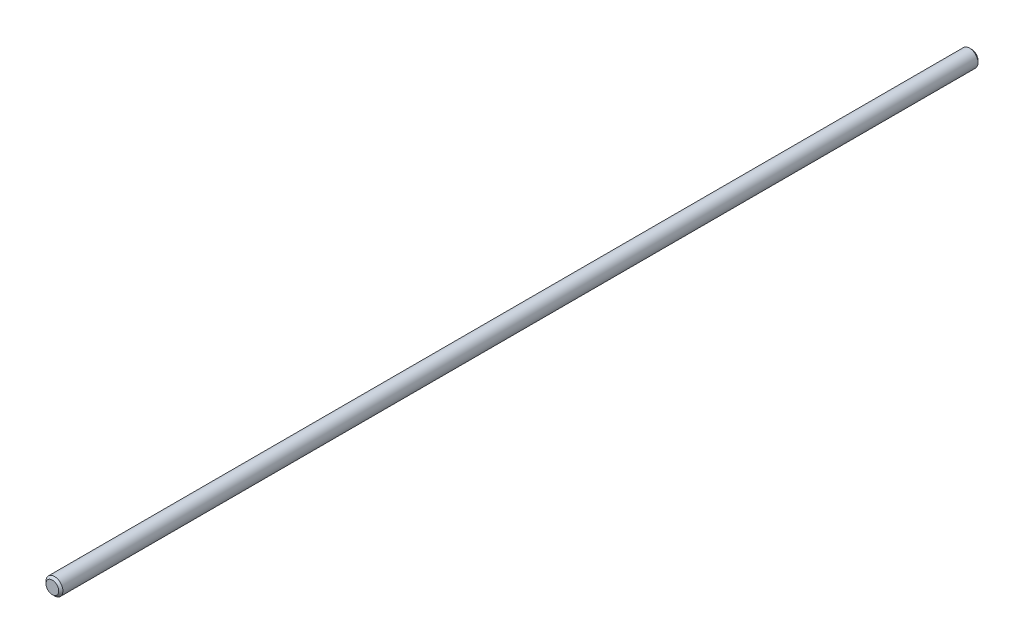
ISO-10303-21;
HEADER;
FILE_DESCRIPTION(('STEP AP214'),'2;1');
FILE_NAME('part.step','',(''),(''),'','','');
FILE_SCHEMA(('AUTOMOTIVE_DESIGN { 1 0 10303 214 1 1 1 1 }'));
ENDSEC;
DATA;
#1=APPLICATION_CONTEXT('core data for automotive mechanical design processes');
#2=APPLICATION_PROTOCOL_DEFINITION('international standard','automotive_design',2000,#1);
#3=PRODUCT_CONTEXT('',#1,'mechanical');
#4=PRODUCT('Part','Part','',(#3));
#5=PRODUCT_RELATED_PRODUCT_CATEGORY('part','',(#4));
#6=PRODUCT_DEFINITION_FORMATION('','',#4);
#7=PRODUCT_DEFINITION_CONTEXT('part definition',#1,'design');
#8=PRODUCT_DEFINITION('design','',#6,#7);
#9=PRODUCT_DEFINITION_SHAPE('','',#8);
#10=(LENGTH_UNIT() NAMED_UNIT(*) SI_UNIT(.MILLI.,.METRE.));
#11=(NAMED_UNIT(*) PLANE_ANGLE_UNIT() SI_UNIT($,.RADIAN.));
#12=(NAMED_UNIT(*) SI_UNIT($,.STERADIAN.) SOLID_ANGLE_UNIT());
#13=UNCERTAINTY_MEASURE_WITH_UNIT(LENGTH_MEASURE(1.E-05),#10,'distance_accuracy_value','');
#14=(GEOMETRIC_REPRESENTATION_CONTEXT(3) GLOBAL_UNCERTAINTY_ASSIGNED_CONTEXT((#13)) GLOBAL_UNIT_ASSIGNED_CONTEXT((#10,
#11,#12)) REPRESENTATION_CONTEXT('',''));
#15=CARTESIAN_POINT('',(0.,0.,0.));
#16=DIRECTION('',(0.,0.,1.));
#17=DIRECTION('',(1.,0.,0.));
#18=AXIS2_PLACEMENT_3D('',#15,#16,#17);
#19=CARTESIAN_POINT('',(0.,0.,435.));
#20=DIRECTION('',(0.,0.,-1.));
#21=DIRECTION('',(-1.,0.,0.));
#22=AXIS2_PLACEMENT_3D('',#19,#20,#21);
#23=CYLINDRICAL_SURFACE('',#22,4.);
#24=CARTESIAN_POINT('',(0.,0.,1.00000000000017));
#25=DIRECTION('',(0.,0.,1.));
#26=DIRECTION('',(1.,0.,0.));
#27=AXIS2_PLACEMENT_3D('',#24,#25,#26);
#28=CIRCLE('',#27,4.);
#29=CARTESIAN_POINT('',(4.,0.,1.00000000000017));
#30=VERTEX_POINT('',#29);
#31=EDGE_CURVE('E46',#30,#30,#28,.T.);
#32=ORIENTED_EDGE('',*,*,#31,.T.);
#33=EDGE_LOOP('',(#32));
#34=FACE_BOUND('',#33,.T.);
#35=CARTESIAN_POINT('',(0.,0.,434.));
#36=DIRECTION('',(0.,0.,1.));
#37=DIRECTION('',(1.,0.,0.));
#38=AXIS2_PLACEMENT_3D('',#35,#36,#37);
#39=CIRCLE('',#38,4.);
#40=CARTESIAN_POINT('',(4.,0.,434.));
#41=VERTEX_POINT('',#40);
#42=EDGE_CURVE('E50',#41,#41,#39,.F.);
#43=ORIENTED_EDGE('',*,*,#42,.T.);
#44=EDGE_LOOP('',(#43));
#45=FACE_BOUND('',#44,.T.);
#46=ADVANCED_FACE('F35',(#34,#45),#23,.T.);
#47=CARTESIAN_POINT('',(0.,0.,435.));
#48=DIRECTION('',(0.,0.,1.));
#49=DIRECTION('',(1.,0.,0.));
#50=AXIS2_PLACEMENT_3D('',#47,#48,#49);
#51=PLANE('',#50);
#52=CARTESIAN_POINT('',(0.,0.,435.));
#53=DIRECTION('',(0.,0.,1.));
#54=DIRECTION('',(1.,0.,0.));
#55=AXIS2_PLACEMENT_3D('',#52,#53,#54);
#56=CIRCLE('',#55,3.00000000000028);
#57=CARTESIAN_POINT('',(3.00000000000028,0.,435.));
#58=VERTEX_POINT('',#57);
#59=EDGE_CURVE('E10',#58,#58,#56,.T.);
#60=ORIENTED_EDGE('',*,*,#59,.T.);
#61=EDGE_LOOP('',(#60));
#62=FACE_BOUND('',#61,.T.);
#63=ADVANCED_FACE('F66',(#62),#51,.T.);
#64=CARTESIAN_POINT('',(0.,0.,0.));
#65=DIRECTION('',(0.,0.,1.));
#66=DIRECTION('',(1.,0.,0.));
#67=AXIS2_PLACEMENT_3D('',#64,#65,#66);
#68=PLANE('',#67);
#69=CARTESIAN_POINT('',(0.,0.,0.));
#70=DIRECTION('',(0.,0.,1.));
#71=DIRECTION('',(1.,0.,0.));
#72=AXIS2_PLACEMENT_3D('',#69,#70,#71);
#73=CIRCLE('',#72,2.99999999999984);
#74=CARTESIAN_POINT('',(2.99999999999984,0.,0.));
#75=VERTEX_POINT('',#74);
#76=EDGE_CURVE('E42',#75,#75,#73,.F.);
#77=ORIENTED_EDGE('',*,*,#76,.T.);
#78=EDGE_LOOP('',(#77));
#79=FACE_BOUND('',#78,.T.);
#80=ADVANCED_FACE('F63',(#79),#68,.F.);
#81=CARTESIAN_POINT('',(0.,0.,1.00000000000017));
#82=DIRECTION('',(0.,0.,1.));
#83=DIRECTION('',(1.,0.,0.));
#84=AXIS2_PLACEMENT_3D('',#81,#82,#83);
#85=CONICAL_SURFACE('',#84,4.,0.785398163397447);
#86=ORIENTED_EDGE('',*,*,#76,.F.);
#87=EDGE_LOOP('',(#86));
#88=FACE_BOUND('',#87,.T.);
#89=ORIENTED_EDGE('',*,*,#31,.F.);
#90=EDGE_LOOP('',(#89));
#91=FACE_BOUND('',#90,.T.);
#92=ADVANCED_FACE('F59',(#88,#91),#85,.T.);
#93=CARTESIAN_POINT('',(0.,0.,435.));
#94=DIRECTION('',(0.,0.,-1.));
#95=DIRECTION('',(-1.,0.,0.));
#96=AXIS2_PLACEMENT_3D('',#93,#94,#95);
#97=CONICAL_SURFACE('',#96,3.00000000000028,0.785398163397447);
#98=ORIENTED_EDGE('',*,*,#42,.F.);
#99=EDGE_LOOP('',(#98));
#100=FACE_BOUND('',#99,.T.);
#101=ORIENTED_EDGE('',*,*,#59,.F.);
#102=EDGE_LOOP('',(#101));
#103=FACE_BOUND('',#102,.T.);
#104=ADVANCED_FACE('F37',(#100,#103),#97,.T.);
#105=CLOSED_SHELL('',(#46,#63,#80,#92,#104));
#106=MANIFOLD_SOLID_BREP('B2',#105);
#107=ADVANCED_BREP_SHAPE_REPRESENTATION('',(#18,#106),#14);
#108=SHAPE_DEFINITION_REPRESENTATION(#9,#107);
ENDSEC;
END-ISO-10303-21;
